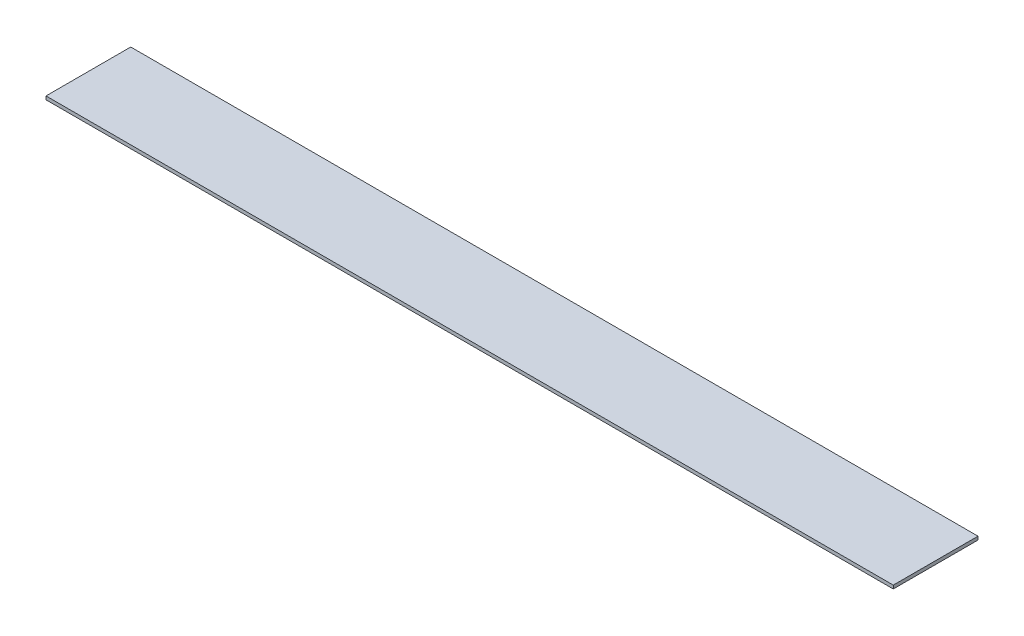
ISO-10303-21;
HEADER;
FILE_DESCRIPTION(('STEP AP214'),'2;1');
FILE_NAME('part.step','',(''),(''),'','','');
FILE_SCHEMA(('AUTOMOTIVE_DESIGN { 1 0 10303 214 1 1 1 1 }'));
ENDSEC;
DATA;
#1=APPLICATION_CONTEXT('core data for automotive mechanical design processes');
#2=APPLICATION_PROTOCOL_DEFINITION('international standard','automotive_design',2000,#1);
#3=PRODUCT_CONTEXT('',#1,'mechanical');
#4=PRODUCT('Part','Part','',(#3));
#5=PRODUCT_RELATED_PRODUCT_CATEGORY('part','',(#4));
#6=PRODUCT_DEFINITION_FORMATION('','',#4);
#7=PRODUCT_DEFINITION_CONTEXT('part definition',#1,'design');
#8=PRODUCT_DEFINITION('design','',#6,#7);
#9=PRODUCT_DEFINITION_SHAPE('','',#8);
#10=(LENGTH_UNIT() NAMED_UNIT(*) SI_UNIT(.MILLI.,.METRE.));
#11=(NAMED_UNIT(*) PLANE_ANGLE_UNIT() SI_UNIT($,.RADIAN.));
#12=(NAMED_UNIT(*) SI_UNIT($,.STERADIAN.) SOLID_ANGLE_UNIT());
#13=UNCERTAINTY_MEASURE_WITH_UNIT(LENGTH_MEASURE(1.E-05),#10,'distance_accuracy_value','');
#14=(GEOMETRIC_REPRESENTATION_CONTEXT(3) GLOBAL_UNCERTAINTY_ASSIGNED_CONTEXT((#13)) GLOBAL_UNIT_ASSIGNED_CONTEXT((#10,
#11,#12)) REPRESENTATION_CONTEXT('',''));
#15=CARTESIAN_POINT('',(0.,0.,0.));
#16=DIRECTION('',(0.,0.,1.));
#17=DIRECTION('',(1.,0.,0.));
#18=AXIS2_PLACEMENT_3D('',#15,#16,#17);
#19=CARTESIAN_POINT('',(0.,1.,0.));
#20=DIRECTION('',(1.,0.,0.));
#21=DIRECTION('',(0.,0.,-1.));
#22=AXIS2_PLACEMENT_3D('',#19,#20,#21);
#23=PLANE('',#22);
#24=DIRECTION('',(0.,0.,1.));
#25=VECTOR('',#24,1.);
#26=CARTESIAN_POINT('',(0.,0.,0.));
#27=LINE('',#26,#25);
#28=CARTESIAN_POINT('',(0.,0.,-25.));
#29=VERTEX_POINT('',#28);
#30=CARTESIAN_POINT('',(0.,0.,0.));
#31=VERTEX_POINT('',#30);
#32=EDGE_CURVE('E96',#29,#31,#27,.T.);
#33=ORIENTED_EDGE('',*,*,#32,.T.);
#34=DIRECTION('',(0.,-1.,0.));
#35=VECTOR('',#34,1.);
#36=CARTESIAN_POINT('',(0.,1.,0.));
#37=LINE('',#36,#35);
#38=CARTESIAN_POINT('',(0.,1.,0.));
#39=VERTEX_POINT('',#38);
#40=EDGE_CURVE('E11',#39,#31,#37,.T.);
#41=ORIENTED_EDGE('',*,*,#40,.F.);
#42=DIRECTION('',(0.,0.,1.));
#43=VECTOR('',#42,1.);
#44=CARTESIAN_POINT('',(0.,1.,0.));
#45=LINE('',#44,#43);
#46=CARTESIAN_POINT('',(0.,1.,-25.));
#47=VERTEX_POINT('',#46);
#48=EDGE_CURVE('E84',#47,#39,#45,.T.);
#49=ORIENTED_EDGE('',*,*,#48,.F.);
#50=DIRECTION('',(0.,-1.,0.));
#51=VECTOR('',#50,1.);
#52=CARTESIAN_POINT('',(0.,1.,-25.));
#53=LINE('',#52,#51);
#54=EDGE_CURVE('E92',#47,#29,#53,.T.);
#55=ORIENTED_EDGE('',*,*,#54,.T.);
#56=EDGE_LOOP('',(#33,#41,#49,#55));
#57=FACE_BOUND('',#56,.T.);
#58=ADVANCED_FACE('F33',(#57),#23,.F.);
#59=CARTESIAN_POINT('',(0.,1.,0.));
#60=DIRECTION('',(0.,0.,-1.));
#61=DIRECTION('',(-1.,0.,0.));
#62=AXIS2_PLACEMENT_3D('',#59,#60,#61);
#63=PLANE('',#62);
#64=DIRECTION('',(1.,0.,0.));
#65=VECTOR('',#64,1.);
#66=CARTESIAN_POINT('',(0.,0.,0.));
#67=LINE('',#66,#65);
#68=CARTESIAN_POINT('',(250.,0.,0.));
#69=VERTEX_POINT('',#68);
#70=EDGE_CURVE('E88',#31,#69,#67,.T.);
#71=ORIENTED_EDGE('',*,*,#70,.T.);
#72=DIRECTION('',(0.,-1.,0.));
#73=VECTOR('',#72,1.);
#74=CARTESIAN_POINT('',(250.,1.,0.));
#75=LINE('',#74,#73);
#76=CARTESIAN_POINT('',(250.,1.,0.));
#77=VERTEX_POINT('',#76);
#78=EDGE_CURVE('E41',#77,#69,#75,.T.);
#79=ORIENTED_EDGE('',*,*,#78,.F.);
#80=DIRECTION('',(1.,0.,0.));
#81=VECTOR('',#80,1.);
#82=CARTESIAN_POINT('',(0.,1.,0.));
#83=LINE('',#82,#81);
#84=EDGE_CURVE('E79',#39,#77,#83,.T.);
#85=ORIENTED_EDGE('',*,*,#84,.F.);
#86=ORIENTED_EDGE('',*,*,#40,.T.);
#87=EDGE_LOOP('',(#71,#79,#85,#86));
#88=FACE_BOUND('',#87,.T.);
#89=ADVANCED_FACE('F87',(#88),#63,.F.);
#90=CARTESIAN_POINT('',(250.,1.,0.));
#91=DIRECTION('',(-1.,0.,0.));
#92=DIRECTION('',(0.,0.,1.));
#93=AXIS2_PLACEMENT_3D('',#90,#91,#92);
#94=PLANE('',#93);
#95=DIRECTION('',(0.,0.,-1.));
#96=VECTOR('',#95,1.);
#97=CARTESIAN_POINT('',(250.,0.,0.));
#98=LINE('',#97,#96);
#99=CARTESIAN_POINT('',(250.,0.,-25.));
#100=VERTEX_POINT('',#99);
#101=EDGE_CURVE('E66',#69,#100,#98,.T.);
#102=ORIENTED_EDGE('',*,*,#101,.T.);
#103=DIRECTION('',(0.,-1.,0.));
#104=VECTOR('',#103,1.);
#105=CARTESIAN_POINT('',(250.,1.,-25.));
#106=LINE('',#105,#104);
#107=CARTESIAN_POINT('',(250.,1.,-25.));
#108=VERTEX_POINT('',#107);
#109=EDGE_CURVE('E89',#108,#100,#106,.T.);
#110=ORIENTED_EDGE('',*,*,#109,.F.);
#111=DIRECTION('',(0.,0.,-1.));
#112=VECTOR('',#111,1.);
#113=CARTESIAN_POINT('',(250.,1.,0.));
#114=LINE('',#113,#112);
#115=EDGE_CURVE('E82',#77,#108,#114,.T.);
#116=ORIENTED_EDGE('',*,*,#115,.F.);
#117=ORIENTED_EDGE('',*,*,#78,.T.);
#118=EDGE_LOOP('',(#102,#110,#116,#117));
#119=FACE_BOUND('',#118,.T.);
#120=ADVANCED_FACE('F90',(#119),#94,.F.);
#121=CARTESIAN_POINT('',(0.,1.,-25.));
#122=DIRECTION('',(0.,0.,1.));
#123=DIRECTION('',(1.,0.,0.));
#124=AXIS2_PLACEMENT_3D('',#121,#122,#123);
#125=PLANE('',#124);
#126=DIRECTION('',(-1.,0.,0.));
#127=VECTOR('',#126,1.);
#128=CARTESIAN_POINT('',(0.,0.,-25.));
#129=LINE('',#128,#127);
#130=EDGE_CURVE('E72',#100,#29,#129,.T.);
#131=ORIENTED_EDGE('',*,*,#130,.T.);
#132=ORIENTED_EDGE('',*,*,#54,.F.);
#133=DIRECTION('',(-1.,0.,0.));
#134=VECTOR('',#133,1.);
#135=CARTESIAN_POINT('',(0.,1.,-25.));
#136=LINE('',#135,#134);
#137=EDGE_CURVE('E49',#108,#47,#136,.T.);
#138=ORIENTED_EDGE('',*,*,#137,.F.);
#139=ORIENTED_EDGE('',*,*,#109,.T.);
#140=EDGE_LOOP('',(#131,#132,#138,#139));
#141=FACE_BOUND('',#140,.T.);
#142=ADVANCED_FACE('F103',(#141),#125,.F.);
#143=CARTESIAN_POINT('',(0.,1.,0.));
#144=DIRECTION('',(0.,-1.,0.));
#145=DIRECTION('',(0.,0.,-1.));
#146=AXIS2_PLACEMENT_3D('',#143,#144,#145);
#147=PLANE('',#146);
#148=ORIENTED_EDGE('',*,*,#48,.T.);
#149=ORIENTED_EDGE('',*,*,#84,.T.);
#150=ORIENTED_EDGE('',*,*,#115,.T.);
#151=ORIENTED_EDGE('',*,*,#137,.T.);
#152=EDGE_LOOP('',(#148,#149,#150,#151));
#153=FACE_BOUND('',#152,.T.);
#154=ADVANCED_FACE('F80',(#153),#147,.F.);
#155=CARTESIAN_POINT('',(0.,0.,0.));
#156=DIRECTION('',(0.,-1.,0.));
#157=DIRECTION('',(0.,0.,-1.));
#158=AXIS2_PLACEMENT_3D('',#155,#156,#157);
#159=PLANE('',#158);
#160=ORIENTED_EDGE('',*,*,#32,.F.);
#161=ORIENTED_EDGE('',*,*,#130,.F.);
#162=ORIENTED_EDGE('',*,*,#101,.F.);
#163=ORIENTED_EDGE('',*,*,#70,.F.);
#164=EDGE_LOOP('',(#160,#161,#162,#163));
#165=FACE_BOUND('',#164,.T.);
#166=ADVANCED_FACE('F106',(#165),#159,.T.);
#167=CLOSED_SHELL('',(#58,#89,#120,#142,#154,#166));
#168=MANIFOLD_SOLID_BREP('B2',#167);
#169=ADVANCED_BREP_SHAPE_REPRESENTATION('',(#18,#168),#14);
#170=SHAPE_DEFINITION_REPRESENTATION(#9,#169);
ENDSEC;
END-ISO-10303-21;
